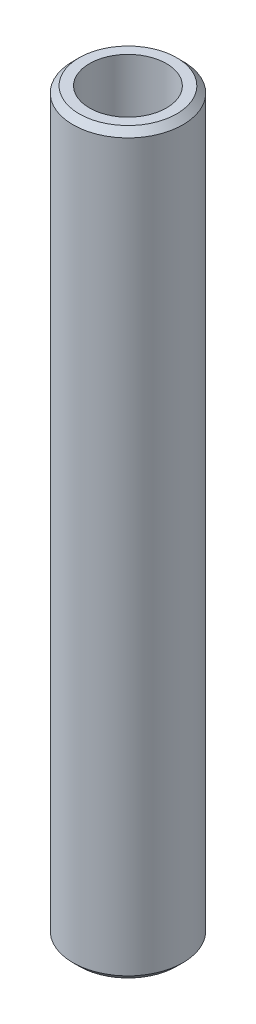
ISO-10303-21;
HEADER;
FILE_DESCRIPTION(('STEP AP214'),'2;1');
FILE_NAME('part.step','',(''),(''),'','','');
FILE_SCHEMA(('AUTOMOTIVE_DESIGN { 1 0 10303 214 1 1 1 1 }'));
ENDSEC;
DATA;
#1=APPLICATION_CONTEXT('core data for automotive mechanical design processes');
#2=APPLICATION_PROTOCOL_DEFINITION('international standard','automotive_design',2000,#1);
#3=PRODUCT_CONTEXT('',#1,'mechanical');
#4=PRODUCT('Part','Part','',(#3));
#5=PRODUCT_RELATED_PRODUCT_CATEGORY('part','',(#4));
#6=PRODUCT_DEFINITION_FORMATION('','',#4);
#7=PRODUCT_DEFINITION_CONTEXT('part definition',#1,'design');
#8=PRODUCT_DEFINITION('design','',#6,#7);
#9=PRODUCT_DEFINITION_SHAPE('','',#8);
#10=(LENGTH_UNIT() NAMED_UNIT(*) SI_UNIT(.MILLI.,.METRE.));
#11=(NAMED_UNIT(*) PLANE_ANGLE_UNIT() SI_UNIT($,.RADIAN.));
#12=(NAMED_UNIT(*) SI_UNIT($,.STERADIAN.) SOLID_ANGLE_UNIT());
#13=UNCERTAINTY_MEASURE_WITH_UNIT(LENGTH_MEASURE(1.E-05),#10,'distance_accuracy_value','');
#14=(GEOMETRIC_REPRESENTATION_CONTEXT(3) GLOBAL_UNCERTAINTY_ASSIGNED_CONTEXT((#13)) GLOBAL_UNIT_ASSIGNED_CONTEXT((#10,
#11,#12)) REPRESENTATION_CONTEXT('',''));
#15=CARTESIAN_POINT('',(0.,0.,0.));
#16=DIRECTION('',(0.,0.,1.));
#17=DIRECTION('',(1.,0.,0.));
#18=AXIS2_PLACEMENT_3D('',#15,#16,#17);
#19=CARTESIAN_POINT('',(0.,436.233759187224,0.));
#20=DIRECTION('',(0.,-1.,0.));
#21=DIRECTION('',(0.,0.,-1.));
#22=AXIS2_PLACEMENT_3D('',#19,#20,#21);
#23=CYLINDRICAL_SURFACE('',#22,32.5);
#24=CARTESIAN_POINT('',(0.,432.526419102051,0.));
#25=DIRECTION('',(0.,1.,0.));
#26=DIRECTION('',(0.,0.,1.));
#27=AXIS2_PLACEMENT_3D('',#24,#25,#26);
#28=CIRCLE('',#27,32.5);
#29=CARTESIAN_POINT('',(0.,432.526419102051,32.5));
#30=VERTEX_POINT('',#29);
#31=EDGE_CURVE('E50',#30,#30,#28,.F.);
#32=ORIENTED_EDGE('',*,*,#31,.T.);
#33=EDGE_LOOP('',(#32));
#34=FACE_BOUND('',#33,.T.);
#35=CARTESIAN_POINT('',(0.,3.70734008517287,0.));
#36=DIRECTION('',(0.,1.,0.));
#37=DIRECTION('',(0.,0.,1.));
#38=AXIS2_PLACEMENT_3D('',#35,#36,#37);
#39=CIRCLE('',#38,32.5);
#40=CARTESIAN_POINT('',(0.,3.70734008517287,32.5));
#41=VERTEX_POINT('',#40);
#42=EDGE_CURVE('E51',#41,#41,#39,.T.);
#43=ORIENTED_EDGE('',*,*,#42,.T.);
#44=EDGE_LOOP('',(#43));
#45=FACE_BOUND('',#44,.T.);
#46=ADVANCED_FACE('F39',(#34,#45),#23,.T.);
#47=CARTESIAN_POINT('',(0.,436.233759187224,0.));
#48=DIRECTION('',(0.,1.,0.));
#49=DIRECTION('',(0.,0.,1.));
#50=AXIS2_PLACEMENT_3D('',#47,#48,#49);
#51=PLANE('',#50);
#52=CARTESIAN_POINT('',(0.,436.233759187224,0.));
#53=DIRECTION('',(0.,1.,0.));
#54=DIRECTION('',(0.,0.,1.));
#55=AXIS2_PLACEMENT_3D('',#52,#53,#54);
#56=CIRCLE('',#55,28.7926599148271);
#57=CARTESIAN_POINT('',(0.,436.233759187224,28.7926599148271));
#58=VERTEX_POINT('',#57);
#59=EDGE_CURVE('E54',#58,#58,#56,.T.);
#60=ORIENTED_EDGE('',*,*,#59,.T.);
#61=EDGE_LOOP('',(#60));
#62=FACE_BOUND('',#61,.T.);
#63=CARTESIAN_POINT('',(0.,436.233759187224,0.));
#64=DIRECTION('',(0.,1.,0.));
#65=DIRECTION('',(0.,0.,1.));
#66=AXIS2_PLACEMENT_3D('',#63,#64,#65);
#67=CIRCLE('',#66,22.7456559654489);
#68=CARTESIAN_POINT('',(0.,436.233759187224,22.7456559654489));
#69=VERTEX_POINT('',#68);
#70=EDGE_CURVE('E58',#69,#69,#67,.T.);
#71=ORIENTED_EDGE('',*,*,#70,.F.);
#72=EDGE_LOOP('',(#71));
#73=FACE_BOUND('',#72,.T.);
#74=ADVANCED_FACE('F69',(#62,#73),#51,.T.);
#75=CARTESIAN_POINT('',(0.,0.,0.));
#76=DIRECTION('',(0.,1.,0.));
#77=DIRECTION('',(0.,0.,1.));
#78=AXIS2_PLACEMENT_3D('',#75,#76,#77);
#79=PLANE('',#78);
#80=CARTESIAN_POINT('',(0.,0.,0.));
#81=DIRECTION('',(0.,1.,0.));
#82=DIRECTION('',(0.,0.,1.));
#83=AXIS2_PLACEMENT_3D('',#80,#81,#82);
#84=CIRCLE('',#83,28.792659914827);
#85=CARTESIAN_POINT('',(0.,0.,28.792659914827));
#86=VERTEX_POINT('',#85);
#87=EDGE_CURVE('E10',#86,#86,#84,.F.);
#88=ORIENTED_EDGE('',*,*,#87,.T.);
#89=EDGE_LOOP('',(#88));
#90=FACE_BOUND('',#89,.T.);
#91=CARTESIAN_POINT('',(0.,0.,0.));
#92=DIRECTION('',(0.,1.,0.));
#93=DIRECTION('',(0.,0.,1.));
#94=AXIS2_PLACEMENT_3D('',#91,#92,#93);
#95=CIRCLE('',#94,22.7456559654489);
#96=CARTESIAN_POINT('',(0.,0.,22.7456559654489));
#97=VERTEX_POINT('',#96);
#98=EDGE_CURVE('E63',#97,#97,#95,.T.);
#99=ORIENTED_EDGE('',*,*,#98,.T.);
#100=EDGE_LOOP('',(#99));
#101=FACE_BOUND('',#100,.T.);
#102=ADVANCED_FACE('F75',(#90,#101),#79,.F.);
#103=CARTESIAN_POINT('',(0.,436.233759187224,0.));
#104=DIRECTION('',(0.,-1.,0.));
#105=DIRECTION('',(0.,0.,-1.));
#106=AXIS2_PLACEMENT_3D('',#103,#104,#105);
#107=CYLINDRICAL_SURFACE('',#106,22.7456559654489);
#108=ORIENTED_EDGE('',*,*,#70,.T.);
#109=EDGE_LOOP('',(#108));
#110=FACE_BOUND('',#109,.T.);
#111=ORIENTED_EDGE('',*,*,#98,.F.);
#112=EDGE_LOOP('',(#111));
#113=FACE_BOUND('',#112,.T.);
#114=ADVANCED_FACE('F70',(#110,#113),#107,.F.);
#115=CARTESIAN_POINT('',(0.,436.233759187224,0.));
#116=DIRECTION('',(0.,-1.,0.));
#117=DIRECTION('',(0.,0.,-1.));
#118=AXIS2_PLACEMENT_3D('',#115,#116,#117);
#119=CONICAL_SURFACE('',#118,28.7926599148271,0.785398163397445);
#120=ORIENTED_EDGE('',*,*,#31,.F.);
#121=EDGE_LOOP('',(#120));
#122=FACE_BOUND('',#121,.T.);
#123=ORIENTED_EDGE('',*,*,#59,.F.);
#124=EDGE_LOOP('',(#123));
#125=FACE_BOUND('',#124,.T.);
#126=ADVANCED_FACE('F81',(#122,#125),#119,.T.);
#127=CARTESIAN_POINT('',(0.,3.70734008517287,0.));
#128=DIRECTION('',(0.,1.,0.));
#129=DIRECTION('',(0.,0.,1.));
#130=AXIS2_PLACEMENT_3D('',#127,#128,#129);
#131=CONICAL_SURFACE('',#130,32.5,0.785398163397459);
#132=ORIENTED_EDGE('',*,*,#87,.F.);
#133=EDGE_LOOP('',(#132));
#134=FACE_BOUND('',#133,.T.);
#135=ORIENTED_EDGE('',*,*,#42,.F.);
#136=EDGE_LOOP('',(#135));
#137=FACE_BOUND('',#136,.T.);
#138=ADVANCED_FACE('F45',(#134,#137),#131,.T.);
#139=CLOSED_SHELL('',(#46,#74,#102,#114,#126,#138));
#140=MANIFOLD_SOLID_BREP('B2',#139);
#141=ADVANCED_BREP_SHAPE_REPRESENTATION('',(#18,#140),#14);
#142=SHAPE_DEFINITION_REPRESENTATION(#9,#141);
ENDSEC;
END-ISO-10303-21;
